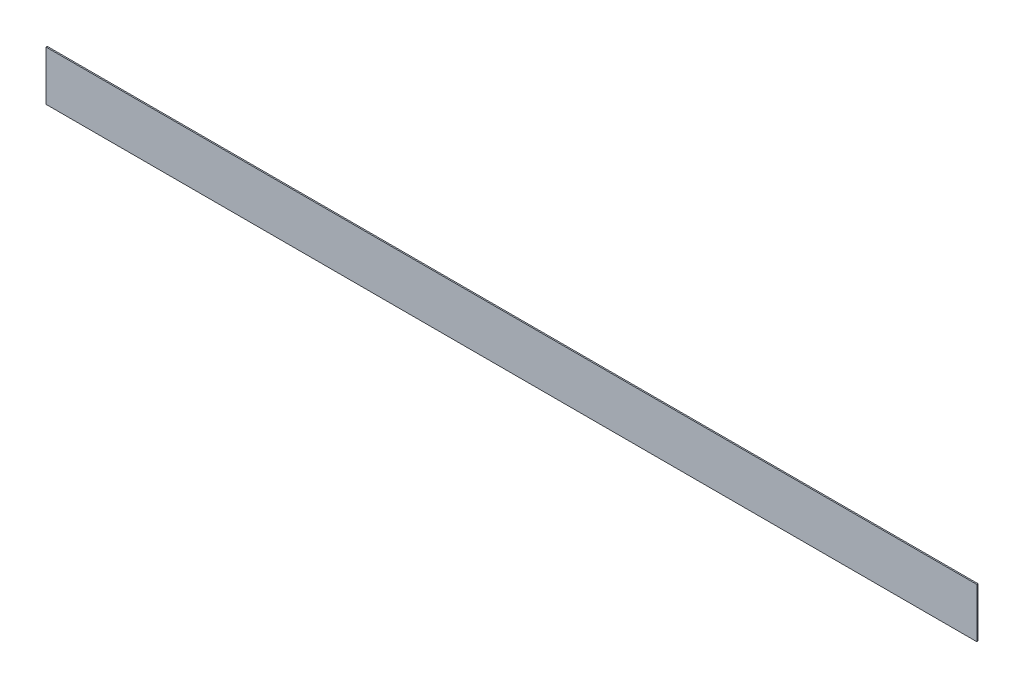
ISO-10303-21;
HEADER;
FILE_DESCRIPTION(('STEP AP214'),'2;1');
FILE_NAME('part.step','',(''),(''),'','','');
FILE_SCHEMA(('AUTOMOTIVE_DESIGN { 1 0 10303 214 1 1 1 1 }'));
ENDSEC;
DATA;
#1=APPLICATION_CONTEXT('core data for automotive mechanical design processes');
#2=APPLICATION_PROTOCOL_DEFINITION('international standard','automotive_design',2000,#1);
#3=PRODUCT_CONTEXT('',#1,'mechanical');
#4=PRODUCT('Part','Part','',(#3));
#5=PRODUCT_RELATED_PRODUCT_CATEGORY('part','',(#4));
#6=PRODUCT_DEFINITION_FORMATION('','',#4);
#7=PRODUCT_DEFINITION_CONTEXT('part definition',#1,'design');
#8=PRODUCT_DEFINITION('design','',#6,#7);
#9=PRODUCT_DEFINITION_SHAPE('','',#8);
#10=(LENGTH_UNIT() NAMED_UNIT(*) SI_UNIT(.MILLI.,.METRE.));
#11=(NAMED_UNIT(*) PLANE_ANGLE_UNIT() SI_UNIT($,.RADIAN.));
#12=(NAMED_UNIT(*) SI_UNIT($,.STERADIAN.) SOLID_ANGLE_UNIT());
#13=UNCERTAINTY_MEASURE_WITH_UNIT(LENGTH_MEASURE(1.E-05),#10,'distance_accuracy_value','');
#14=(GEOMETRIC_REPRESENTATION_CONTEXT(3) GLOBAL_UNCERTAINTY_ASSIGNED_CONTEXT((#13)) GLOBAL_UNIT_ASSIGNED_CONTEXT((#10,
#11,#12)) REPRESENTATION_CONTEXT('',''));
#15=CARTESIAN_POINT('',(0.,0.,0.));
#16=DIRECTION('',(0.,0.,1.));
#17=DIRECTION('',(1.,0.,0.));
#18=AXIS2_PLACEMENT_3D('',#15,#16,#17);
#19=CARTESIAN_POINT('',(0.,0.,0.1));
#20=DIRECTION('',(1.,0.,0.));
#21=DIRECTION('',(0.,0.,-1.));
#22=AXIS2_PLACEMENT_3D('',#19,#20,#21);
#23=PLANE('',#22);
#24=DIRECTION('',(0.,-1.,0.));
#25=VECTOR('',#24,1.);
#26=CARTESIAN_POINT('',(0.,0.,0.));
#27=LINE('',#26,#25);
#28=CARTESIAN_POINT('',(0.,0.,0.));
#29=VERTEX_POINT('',#28);
#30=CARTESIAN_POINT('',(0.,-4.,0.));
#31=VERTEX_POINT('',#30);
#32=EDGE_CURVE('E98',#29,#31,#27,.T.);
#33=ORIENTED_EDGE('',*,*,#32,.T.);
#34=DIRECTION('',(0.,0.,-1.));
#35=VECTOR('',#34,1.);
#36=CARTESIAN_POINT('',(0.,-4.,0.1));
#37=LINE('',#36,#35);
#38=CARTESIAN_POINT('',(0.,-4.,0.1));
#39=VERTEX_POINT('',#38);
#40=EDGE_CURVE('E11',#39,#31,#37,.T.);
#41=ORIENTED_EDGE('',*,*,#40,.F.);
#42=DIRECTION('',(0.,-1.,0.));
#43=VECTOR('',#42,1.);
#44=CARTESIAN_POINT('',(0.,0.,0.1));
#45=LINE('',#44,#43);
#46=CARTESIAN_POINT('',(0.,0.,0.1));
#47=VERTEX_POINT('',#46);
#48=EDGE_CURVE('E86',#47,#39,#45,.T.);
#49=ORIENTED_EDGE('',*,*,#48,.F.);
#50=DIRECTION('',(0.,0.,-1.));
#51=VECTOR('',#50,1.);
#52=CARTESIAN_POINT('',(0.,0.,0.1));
#53=LINE('',#52,#51);
#54=EDGE_CURVE('E94',#47,#29,#53,.T.);
#55=ORIENTED_EDGE('',*,*,#54,.T.);
#56=EDGE_LOOP('',(#33,#41,#49,#55));
#57=FACE_BOUND('',#56,.T.);
#58=ADVANCED_FACE('F35',(#57),#23,.F.);
#59=CARTESIAN_POINT('',(0.,-4.,0.1));
#60=DIRECTION('',(0.,1.,0.));
#61=DIRECTION('',(0.,0.,1.));
#62=AXIS2_PLACEMENT_3D('',#59,#60,#61);
#63=PLANE('',#62);
#64=DIRECTION('',(1.,0.,0.));
#65=VECTOR('',#64,1.);
#66=CARTESIAN_POINT('',(0.,-4.,0.));
#67=LINE('',#66,#65);
#68=CARTESIAN_POINT('',(75.,-4.,0.));
#69=VERTEX_POINT('',#68);
#70=EDGE_CURVE('E90',#31,#69,#67,.T.);
#71=ORIENTED_EDGE('',*,*,#70,.T.);
#72=DIRECTION('',(0.,0.,-1.));
#73=VECTOR('',#72,1.);
#74=CARTESIAN_POINT('',(75.,-4.,0.1));
#75=LINE('',#74,#73);
#76=CARTESIAN_POINT('',(75.,-4.,0.1));
#77=VERTEX_POINT('',#76);
#78=EDGE_CURVE('E43',#77,#69,#75,.T.);
#79=ORIENTED_EDGE('',*,*,#78,.F.);
#80=DIRECTION('',(1.,0.,0.));
#81=VECTOR('',#80,1.);
#82=CARTESIAN_POINT('',(0.,-4.,0.1));
#83=LINE('',#82,#81);
#84=EDGE_CURVE('E81',#39,#77,#83,.T.);
#85=ORIENTED_EDGE('',*,*,#84,.F.);
#86=ORIENTED_EDGE('',*,*,#40,.T.);
#87=EDGE_LOOP('',(#71,#79,#85,#86));
#88=FACE_BOUND('',#87,.T.);
#89=ADVANCED_FACE('F89',(#88),#63,.F.);
#90=CARTESIAN_POINT('',(75.,0.,0.1));
#91=DIRECTION('',(-1.,0.,0.));
#92=DIRECTION('',(0.,0.,1.));
#93=AXIS2_PLACEMENT_3D('',#90,#91,#92);
#94=PLANE('',#93);
#95=DIRECTION('',(0.,1.,0.));
#96=VECTOR('',#95,1.);
#97=CARTESIAN_POINT('',(75.,0.,0.));
#98=LINE('',#97,#96);
#99=CARTESIAN_POINT('',(75.,0.,0.));
#100=VERTEX_POINT('',#99);
#101=EDGE_CURVE('E68',#69,#100,#98,.T.);
#102=ORIENTED_EDGE('',*,*,#101,.T.);
#103=DIRECTION('',(0.,0.,-1.));
#104=VECTOR('',#103,1.);
#105=CARTESIAN_POINT('',(75.,0.,0.1));
#106=LINE('',#105,#104);
#107=CARTESIAN_POINT('',(75.,0.,0.1));
#108=VERTEX_POINT('',#107);
#109=EDGE_CURVE('E91',#108,#100,#106,.T.);
#110=ORIENTED_EDGE('',*,*,#109,.F.);
#111=DIRECTION('',(0.,1.,0.));
#112=VECTOR('',#111,1.);
#113=CARTESIAN_POINT('',(75.,0.,0.1));
#114=LINE('',#113,#112);
#115=EDGE_CURVE('E84',#77,#108,#114,.T.);
#116=ORIENTED_EDGE('',*,*,#115,.F.);
#117=ORIENTED_EDGE('',*,*,#78,.T.);
#118=EDGE_LOOP('',(#102,#110,#116,#117));
#119=FACE_BOUND('',#118,.T.);
#120=ADVANCED_FACE('F92',(#119),#94,.F.);
#121=CARTESIAN_POINT('',(0.,0.,0.1));
#122=DIRECTION('',(0.,-1.,0.));
#123=DIRECTION('',(0.,0.,-1.));
#124=AXIS2_PLACEMENT_3D('',#121,#122,#123);
#125=PLANE('',#124);
#126=DIRECTION('',(-1.,0.,0.));
#127=VECTOR('',#126,1.);
#128=CARTESIAN_POINT('',(0.,0.,0.));
#129=LINE('',#128,#127);
#130=EDGE_CURVE('E74',#100,#29,#129,.T.);
#131=ORIENTED_EDGE('',*,*,#130,.T.);
#132=ORIENTED_EDGE('',*,*,#54,.F.);
#133=DIRECTION('',(-1.,0.,0.));
#134=VECTOR('',#133,1.);
#135=CARTESIAN_POINT('',(0.,0.,0.1));
#136=LINE('',#135,#134);
#137=EDGE_CURVE('E51',#108,#47,#136,.T.);
#138=ORIENTED_EDGE('',*,*,#137,.F.);
#139=ORIENTED_EDGE('',*,*,#109,.T.);
#140=EDGE_LOOP('',(#131,#132,#138,#139));
#141=FACE_BOUND('',#140,.T.);
#142=ADVANCED_FACE('F105',(#141),#125,.F.);
#143=CARTESIAN_POINT('',(0.,0.,0.1));
#144=DIRECTION('',(0.,0.,1.));
#145=DIRECTION('',(1.,0.,0.));
#146=AXIS2_PLACEMENT_3D('',#143,#144,#145);
#147=PLANE('',#146);
#148=ORIENTED_EDGE('',*,*,#48,.T.);
#149=ORIENTED_EDGE('',*,*,#84,.T.);
#150=ORIENTED_EDGE('',*,*,#115,.T.);
#151=ORIENTED_EDGE('',*,*,#137,.T.);
#152=EDGE_LOOP('',(#148,#149,#150,#151));
#153=FACE_BOUND('',#152,.T.);
#154=ADVANCED_FACE('F82',(#153),#147,.T.);
#155=CARTESIAN_POINT('',(0.,0.,0.));
#156=DIRECTION('',(0.,0.,1.));
#157=DIRECTION('',(1.,0.,0.));
#158=AXIS2_PLACEMENT_3D('',#155,#156,#157);
#159=PLANE('',#158);
#160=ORIENTED_EDGE('',*,*,#32,.F.);
#161=ORIENTED_EDGE('',*,*,#130,.F.);
#162=ORIENTED_EDGE('',*,*,#101,.F.);
#163=ORIENTED_EDGE('',*,*,#70,.F.);
#164=EDGE_LOOP('',(#160,#161,#162,#163));
#165=FACE_BOUND('',#164,.T.);
#166=ADVANCED_FACE('F108',(#165),#159,.F.);
#167=CLOSED_SHELL('',(#58,#89,#120,#142,#154,#166));
#168=MANIFOLD_SOLID_BREP('B2',#167);
#169=ADVANCED_BREP_SHAPE_REPRESENTATION('',(#18,#168),#14);
#170=SHAPE_DEFINITION_REPRESENTATION(#9,#169);
ENDSEC;
END-ISO-10303-21;
